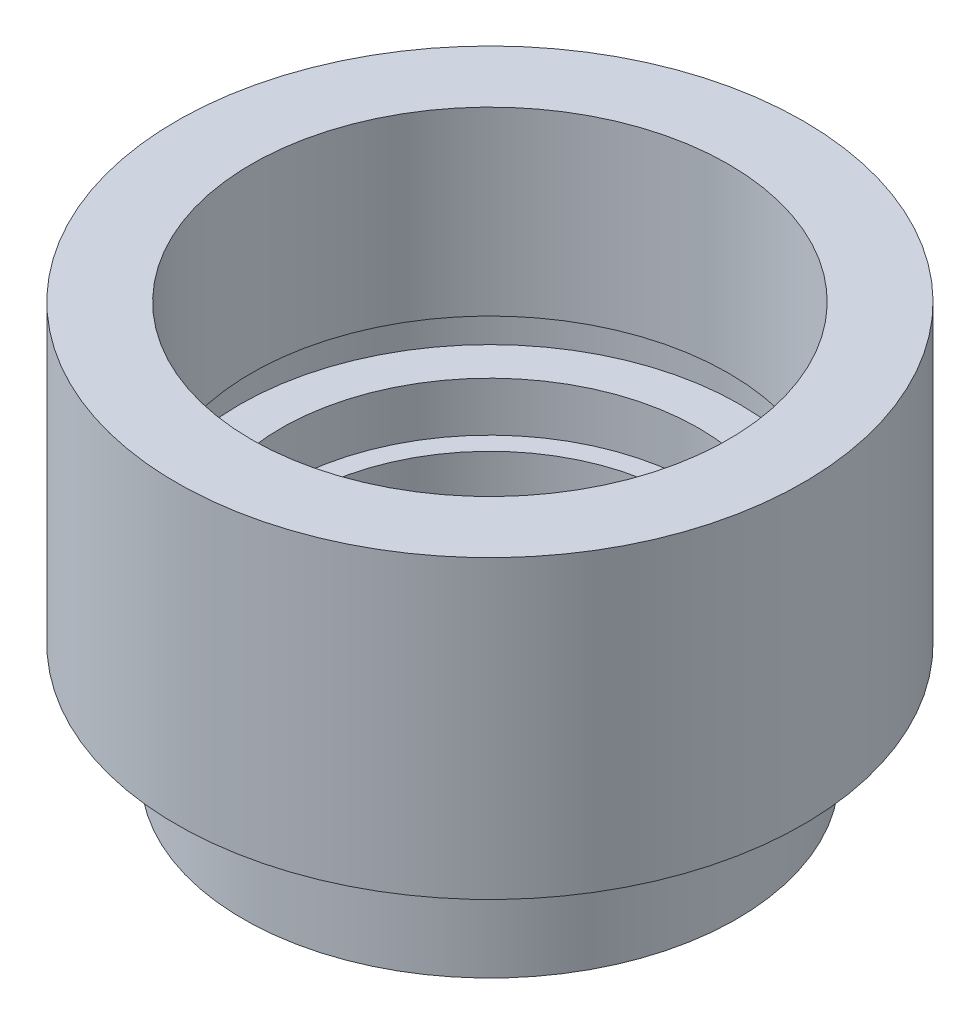
ISO-10303-21;
HEADER;
FILE_DESCRIPTION(('STEP AP214'),'2;1');
FILE_NAME('part.step','',(''),(''),'','','');
FILE_SCHEMA(('AUTOMOTIVE_DESIGN { 1 0 10303 214 1 1 1 1 }'));
ENDSEC;
DATA;
#1=APPLICATION_CONTEXT('core data for automotive mechanical design processes');
#2=APPLICATION_PROTOCOL_DEFINITION('international standard','automotive_design',2000,#1);
#3=PRODUCT_CONTEXT('',#1,'mechanical');
#4=PRODUCT('Part','Part','',(#3));
#5=PRODUCT_RELATED_PRODUCT_CATEGORY('part','',(#4));
#6=PRODUCT_DEFINITION_FORMATION('','',#4);
#7=PRODUCT_DEFINITION_CONTEXT('part definition',#1,'design');
#8=PRODUCT_DEFINITION('design','',#6,#7);
#9=PRODUCT_DEFINITION_SHAPE('','',#8);
#10=(LENGTH_UNIT() NAMED_UNIT(*) SI_UNIT(.MILLI.,.METRE.));
#11=(NAMED_UNIT(*) PLANE_ANGLE_UNIT() SI_UNIT($,.RADIAN.));
#12=(NAMED_UNIT(*) SI_UNIT($,.STERADIAN.) SOLID_ANGLE_UNIT());
#13=UNCERTAINTY_MEASURE_WITH_UNIT(LENGTH_MEASURE(1.E-05),#10,'distance_accuracy_value','');
#14=(GEOMETRIC_REPRESENTATION_CONTEXT(3) GLOBAL_UNCERTAINTY_ASSIGNED_CONTEXT((#13)) GLOBAL_UNIT_ASSIGNED_CONTEXT((#10,
#11,#12)) REPRESENTATION_CONTEXT('',''));
#15=CARTESIAN_POINT('',(0.,0.,0.));
#16=DIRECTION('',(0.,0.,1.));
#17=DIRECTION('',(1.,0.,0.));
#18=AXIS2_PLACEMENT_3D('',#15,#16,#17);
#19=CARTESIAN_POINT('',(0.,0.,0.));
#20=DIRECTION('',(0.,-1.,0.));
#21=DIRECTION('',(0.,0.,-1.));
#22=AXIS2_PLACEMENT_3D('',#19,#20,#21);
#23=CYLINDRICAL_SURFACE('',#22,5.75);
#24=CARTESIAN_POINT('',(0.,0.,0.));
#25=DIRECTION('',(0.,-1.,0.));
#26=DIRECTION('',(0.,0.,-1.));
#27=AXIS2_PLACEMENT_3D('',#24,#25,#26);
#28=CIRCLE('',#27,5.75);
#29=CARTESIAN_POINT('',(0.,0.,-5.75));
#30=VERTEX_POINT('',#29);
#31=EDGE_CURVE('E10',#30,#30,#28,.T.);
#32=ORIENTED_EDGE('',*,*,#31,.T.);
#33=EDGE_LOOP('',(#32));
#34=FACE_BOUND('',#33,.T.);
#35=CARTESIAN_POINT('',(0.,4.5,0.));
#36=DIRECTION('',(0.,-1.,0.));
#37=DIRECTION('',(0.,0.,-1.));
#38=AXIS2_PLACEMENT_3D('',#35,#36,#37);
#39=CIRCLE('',#38,5.75);
#40=CARTESIAN_POINT('',(0.,4.5,-5.75));
#41=VERTEX_POINT('',#40);
#42=EDGE_CURVE('E103',#41,#41,#39,.T.);
#43=ORIENTED_EDGE('',*,*,#42,.F.);
#44=EDGE_LOOP('',(#43));
#45=FACE_BOUND('',#44,.T.);
#46=ADVANCED_FACE('F43',(#34,#45),#23,.F.);
#47=CARTESIAN_POINT('',(5.75,0.,0.));
#48=DIRECTION('',(0.,-1.,0.));
#49=DIRECTION('',(0.,0.,-1.));
#50=AXIS2_PLACEMENT_3D('',#47,#48,#49);
#51=PLANE('',#50);
#52=CARTESIAN_POINT('',(0.,0.,0.));
#53=DIRECTION('',(0.,-1.,0.));
#54=DIRECTION('',(0.,0.,-1.));
#55=AXIS2_PLACEMENT_3D('',#52,#53,#54);
#56=CIRCLE('',#55,7.5);
#57=CARTESIAN_POINT('',(0.,0.,-7.5));
#58=VERTEX_POINT('',#57);
#59=EDGE_CURVE('E50',#58,#58,#56,.T.);
#60=ORIENTED_EDGE('',*,*,#59,.T.);
#61=EDGE_LOOP('',(#60));
#62=FACE_BOUND('',#61,.T.);
#63=ORIENTED_EDGE('',*,*,#31,.F.);
#64=EDGE_LOOP('',(#63));
#65=FACE_BOUND('',#64,.T.);
#66=ADVANCED_FACE('F111',(#62,#65),#51,.T.);
#67=CARTESIAN_POINT('',(0.,0.,0.));
#68=DIRECTION('',(0.,-1.,0.));
#69=DIRECTION('',(0.,0.,-1.));
#70=AXIS2_PLACEMENT_3D('',#67,#68,#69);
#71=CYLINDRICAL_SURFACE('',#70,7.5);
#72=CARTESIAN_POINT('',(0.,2.5,0.));
#73=DIRECTION('',(0.,-1.,0.));
#74=DIRECTION('',(0.,0.,-1.));
#75=AXIS2_PLACEMENT_3D('',#72,#73,#74);
#76=CIRCLE('',#75,7.5);
#77=CARTESIAN_POINT('',(0.,2.5,-7.5));
#78=VERTEX_POINT('',#77);
#79=EDGE_CURVE('E57',#78,#78,#76,.T.);
#80=ORIENTED_EDGE('',*,*,#79,.T.);
#81=EDGE_LOOP('',(#80));
#82=FACE_BOUND('',#81,.T.);
#83=ORIENTED_EDGE('',*,*,#59,.F.);
#84=EDGE_LOOP('',(#83));
#85=FACE_BOUND('',#84,.T.);
#86=ADVANCED_FACE('F115',(#82,#85),#71,.T.);
#87=CARTESIAN_POINT('',(7.5,2.5,0.));
#88=DIRECTION('',(0.,1.,0.));
#89=DIRECTION('',(0.,0.,1.));
#90=AXIS2_PLACEMENT_3D('',#87,#88,#89);
#91=PLANE('',#90);
#92=CARTESIAN_POINT('',(0.,2.5,0.));
#93=DIRECTION('',(0.,-1.,0.));
#94=DIRECTION('',(0.,0.,-1.));
#95=AXIS2_PLACEMENT_3D('',#92,#93,#94);
#96=CIRCLE('',#95,7.);
#97=CARTESIAN_POINT('',(0.,2.5,-7.));
#98=VERTEX_POINT('',#97);
#99=EDGE_CURVE('E63',#98,#98,#96,.T.);
#100=ORIENTED_EDGE('',*,*,#99,.T.);
#101=EDGE_LOOP('',(#100));
#102=FACE_BOUND('',#101,.T.);
#103=ORIENTED_EDGE('',*,*,#79,.F.);
#104=EDGE_LOOP('',(#103));
#105=FACE_BOUND('',#104,.T.);
#106=ADVANCED_FACE('F119',(#102,#105),#91,.T.);
#107=CARTESIAN_POINT('',(0.,0.,0.));
#108=DIRECTION('',(0.,-1.,0.));
#109=DIRECTION('',(0.,0.,-1.));
#110=AXIS2_PLACEMENT_3D('',#107,#108,#109);
#111=CYLINDRICAL_SURFACE('',#110,7.);
#112=CARTESIAN_POINT('',(0.,3.5,0.));
#113=DIRECTION('',(0.,-1.,0.));
#114=DIRECTION('',(0.,0.,-1.));
#115=AXIS2_PLACEMENT_3D('',#112,#113,#114);
#116=CIRCLE('',#115,7.);
#117=CARTESIAN_POINT('',(0.,3.5,-7.));
#118=VERTEX_POINT('',#117);
#119=EDGE_CURVE('E68',#118,#118,#116,.T.);
#120=ORIENTED_EDGE('',*,*,#119,.T.);
#121=EDGE_LOOP('',(#120));
#122=FACE_BOUND('',#121,.T.);
#123=ORIENTED_EDGE('',*,*,#99,.F.);
#124=EDGE_LOOP('',(#123));
#125=FACE_BOUND('',#124,.T.);
#126=ADVANCED_FACE('F126',(#122,#125),#111,.T.);
#127=CARTESIAN_POINT('',(7.,3.5,0.));
#128=DIRECTION('',(0.,-1.,0.));
#129=DIRECTION('',(0.,0.,-1.));
#130=AXIS2_PLACEMENT_3D('',#127,#128,#129);
#131=PLANE('',#130);
#132=CARTESIAN_POINT('',(0.,3.5,0.));
#133=DIRECTION('',(0.,-1.,0.));
#134=DIRECTION('',(0.,0.,-1.));
#135=AXIS2_PLACEMENT_3D('',#132,#133,#134);
#136=CIRCLE('',#135,9.525);
#137=CARTESIAN_POINT('',(0.,3.5,-9.525));
#138=VERTEX_POINT('',#137);
#139=EDGE_CURVE('E72',#138,#138,#136,.T.);
#140=ORIENTED_EDGE('',*,*,#139,.T.);
#141=EDGE_LOOP('',(#140));
#142=FACE_BOUND('',#141,.T.);
#143=ORIENTED_EDGE('',*,*,#119,.F.);
#144=EDGE_LOOP('',(#143));
#145=FACE_BOUND('',#144,.T.);
#146=ADVANCED_FACE('F130',(#142,#145),#131,.T.);
#147=CARTESIAN_POINT('',(0.,0.,0.));
#148=DIRECTION('',(0.,-1.,0.));
#149=DIRECTION('',(0.,0.,-1.));
#150=AXIS2_PLACEMENT_3D('',#147,#148,#149);
#151=CYLINDRICAL_SURFACE('',#150,9.525);
#152=CARTESIAN_POINT('',(0.,12.5,0.));
#153=DIRECTION('',(0.,-1.,0.));
#154=DIRECTION('',(0.,0.,-1.));
#155=AXIS2_PLACEMENT_3D('',#152,#153,#154);
#156=CIRCLE('',#155,9.525);
#157=CARTESIAN_POINT('',(0.,12.5,-9.525));
#158=VERTEX_POINT('',#157);
#159=EDGE_CURVE('E76',#158,#158,#156,.T.);
#160=ORIENTED_EDGE('',*,*,#159,.T.);
#161=EDGE_LOOP('',(#160));
#162=FACE_BOUND('',#161,.T.);
#163=ORIENTED_EDGE('',*,*,#139,.F.);
#164=EDGE_LOOP('',(#163));
#165=FACE_BOUND('',#164,.T.);
#166=ADVANCED_FACE('F134',(#162,#165),#151,.T.);
#167=CARTESIAN_POINT('',(9.525,12.5,0.));
#168=DIRECTION('',(0.,1.,0.));
#169=DIRECTION('',(0.,0.,1.));
#170=AXIS2_PLACEMENT_3D('',#167,#168,#169);
#171=PLANE('',#170);
#172=CARTESIAN_POINT('',(0.,12.5,0.));
#173=DIRECTION('',(0.,-1.,0.));
#174=DIRECTION('',(0.,0.,-1.));
#175=AXIS2_PLACEMENT_3D('',#172,#173,#174);
#176=CIRCLE('',#175,7.25);
#177=CARTESIAN_POINT('',(0.,12.5,-7.25));
#178=VERTEX_POINT('',#177);
#179=EDGE_CURVE('E79',#178,#178,#176,.T.);
#180=ORIENTED_EDGE('',*,*,#179,.T.);
#181=EDGE_LOOP('',(#180));
#182=FACE_BOUND('',#181,.T.);
#183=ORIENTED_EDGE('',*,*,#159,.F.);
#184=EDGE_LOOP('',(#183));
#185=FACE_BOUND('',#184,.T.);
#186=ADVANCED_FACE('F138',(#182,#185),#171,.T.);
#187=CARTESIAN_POINT('',(0.,0.,0.));
#188=DIRECTION('',(0.,-1.,0.));
#189=DIRECTION('',(0.,0.,-1.));
#190=AXIS2_PLACEMENT_3D('',#187,#188,#189);
#191=CYLINDRICAL_SURFACE('',#190,7.25);
#192=CARTESIAN_POINT('',(0.,7.,0.));
#193=DIRECTION('',(0.,-1.,0.));
#194=DIRECTION('',(0.,0.,-1.));
#195=AXIS2_PLACEMENT_3D('',#192,#193,#194);
#196=CIRCLE('',#195,7.25);
#197=CARTESIAN_POINT('',(0.,7.,-7.25));
#198=VERTEX_POINT('',#197);
#199=EDGE_CURVE('E83',#198,#198,#196,.T.);
#200=ORIENTED_EDGE('',*,*,#199,.T.);
#201=EDGE_LOOP('',(#200));
#202=FACE_BOUND('',#201,.T.);
#203=ORIENTED_EDGE('',*,*,#179,.F.);
#204=EDGE_LOOP('',(#203));
#205=FACE_BOUND('',#204,.T.);
#206=ADVANCED_FACE('F142',(#202,#205),#191,.F.);
#207=CARTESIAN_POINT('',(7.25,7.,0.));
#208=DIRECTION('',(0.,-1.,0.));
#209=DIRECTION('',(0.,0.,-1.));
#210=AXIS2_PLACEMENT_3D('',#207,#208,#209);
#211=PLANE('',#210);
#212=CARTESIAN_POINT('',(0.,7.,0.));
#213=DIRECTION('',(0.,-1.,0.));
#214=DIRECTION('',(0.,0.,-1.));
#215=AXIS2_PLACEMENT_3D('',#212,#213,#214);
#216=CIRCLE('',#215,7.6);
#217=CARTESIAN_POINT('',(0.,7.,-7.6));
#218=VERTEX_POINT('',#217);
#219=EDGE_CURVE('E87',#218,#218,#216,.T.);
#220=ORIENTED_EDGE('',*,*,#219,.T.);
#221=EDGE_LOOP('',(#220));
#222=FACE_BOUND('',#221,.T.);
#223=ORIENTED_EDGE('',*,*,#199,.F.);
#224=EDGE_LOOP('',(#223));
#225=FACE_BOUND('',#224,.T.);
#226=ADVANCED_FACE('F146',(#222,#225),#211,.T.);
#227=CARTESIAN_POINT('',(0.,0.,0.));
#228=DIRECTION('',(0.,-1.,0.));
#229=DIRECTION('',(0.,0.,-1.));
#230=AXIS2_PLACEMENT_3D('',#227,#228,#229);
#231=CYLINDRICAL_SURFACE('',#230,7.6);
#232=CARTESIAN_POINT('',(0.,6.,0.));
#233=DIRECTION('',(0.,-1.,0.));
#234=DIRECTION('',(0.,0.,-1.));
#235=AXIS2_PLACEMENT_3D('',#232,#233,#234);
#236=CIRCLE('',#235,7.6);
#237=CARTESIAN_POINT('',(0.,6.,-7.6));
#238=VERTEX_POINT('',#237);
#239=EDGE_CURVE('E91',#238,#238,#236,.T.);
#240=ORIENTED_EDGE('',*,*,#239,.T.);
#241=EDGE_LOOP('',(#240));
#242=FACE_BOUND('',#241,.T.);
#243=ORIENTED_EDGE('',*,*,#219,.F.);
#244=EDGE_LOOP('',(#243));
#245=FACE_BOUND('',#244,.T.);
#246=ADVANCED_FACE('F150',(#242,#245),#231,.F.);
#247=CARTESIAN_POINT('',(7.6,6.,0.));
#248=DIRECTION('',(0.,1.,0.));
#249=DIRECTION('',(0.,0.,1.));
#250=AXIS2_PLACEMENT_3D('',#247,#248,#249);
#251=PLANE('',#250);
#252=CARTESIAN_POINT('',(0.,6.,0.));
#253=DIRECTION('',(0.,-1.,0.));
#254=DIRECTION('',(0.,0.,-1.));
#255=AXIS2_PLACEMENT_3D('',#252,#253,#254);
#256=CIRCLE('',#255,6.35);
#257=CARTESIAN_POINT('',(0.,6.,-6.35));
#258=VERTEX_POINT('',#257);
#259=EDGE_CURVE('E95',#258,#258,#256,.T.);
#260=ORIENTED_EDGE('',*,*,#259,.T.);
#261=EDGE_LOOP('',(#260));
#262=FACE_BOUND('',#261,.T.);
#263=ORIENTED_EDGE('',*,*,#239,.F.);
#264=EDGE_LOOP('',(#263));
#265=FACE_BOUND('',#264,.T.);
#266=ADVANCED_FACE('F154',(#262,#265),#251,.T.);
#267=CARTESIAN_POINT('',(0.,0.,0.));
#268=DIRECTION('',(0.,-1.,0.));
#269=DIRECTION('',(0.,0.,-1.));
#270=AXIS2_PLACEMENT_3D('',#267,#268,#269);
#271=CYLINDRICAL_SURFACE('',#270,6.35);
#272=CARTESIAN_POINT('',(0.,4.5,0.));
#273=DIRECTION('',(0.,-1.,0.));
#274=DIRECTION('',(0.,0.,-1.));
#275=AXIS2_PLACEMENT_3D('',#272,#273,#274);
#276=CIRCLE('',#275,6.35);
#277=CARTESIAN_POINT('',(0.,4.5,-6.35));
#278=VERTEX_POINT('',#277);
#279=EDGE_CURVE('E99',#278,#278,#276,.T.);
#280=ORIENTED_EDGE('',*,*,#279,.T.);
#281=EDGE_LOOP('',(#280));
#282=FACE_BOUND('',#281,.T.);
#283=ORIENTED_EDGE('',*,*,#259,.F.);
#284=EDGE_LOOP('',(#283));
#285=FACE_BOUND('',#284,.T.);
#286=ADVANCED_FACE('F158',(#282,#285),#271,.F.);
#287=CARTESIAN_POINT('',(6.35,4.5,0.));
#288=DIRECTION('',(0.,1.,0.));
#289=DIRECTION('',(0.,0.,1.));
#290=AXIS2_PLACEMENT_3D('',#287,#288,#289);
#291=PLANE('',#290);
#292=ORIENTED_EDGE('',*,*,#42,.T.);
#293=EDGE_LOOP('',(#292));
#294=FACE_BOUND('',#293,.T.);
#295=ORIENTED_EDGE('',*,*,#279,.F.);
#296=EDGE_LOOP('',(#295));
#297=FACE_BOUND('',#296,.T.);
#298=ADVANCED_FACE('F107',(#294,#297),#291,.T.);
#299=CLOSED_SHELL('',(#46,#66,#86,#106,#126,#146,#166,#186,#206,#226,#246,#266,#286,#298));
#300=MANIFOLD_SOLID_BREP('B2',#299);
#301=ADVANCED_BREP_SHAPE_REPRESENTATION('',(#18,#300),#14);
#302=SHAPE_DEFINITION_REPRESENTATION(#9,#301);
ENDSEC;
END-ISO-10303-21;
